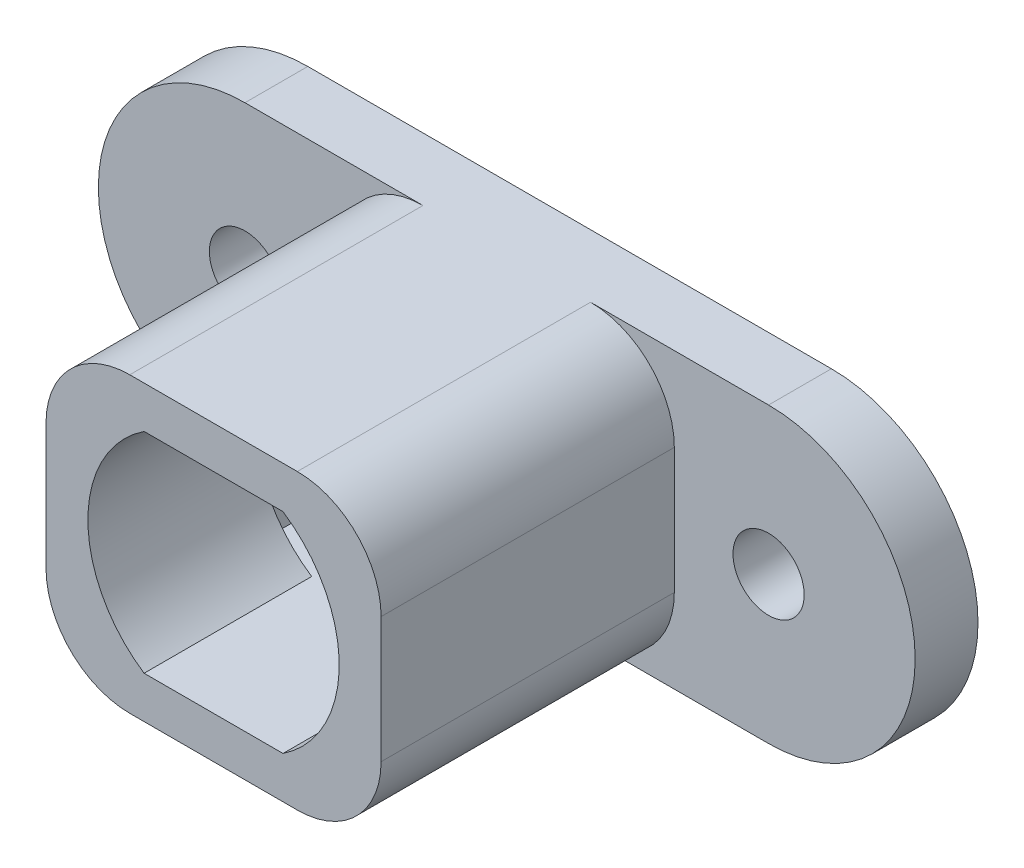
ISO-10303-21;
HEADER;
FILE_DESCRIPTION(('STEP AP214'),'2;1');
FILE_NAME('part.step','',(''),(''),'','','');
FILE_SCHEMA(('AUTOMOTIVE_DESIGN { 1 0 10303 214 1 1 1 1 }'));
ENDSEC;
DATA;
#1=APPLICATION_CONTEXT('core data for automotive mechanical design processes');
#2=APPLICATION_PROTOCOL_DEFINITION('international standard','automotive_design',2000,#1);
#3=PRODUCT_CONTEXT('',#1,'mechanical');
#4=PRODUCT('Part','Part','',(#3));
#5=PRODUCT_RELATED_PRODUCT_CATEGORY('part','',(#4));
#6=PRODUCT_DEFINITION_FORMATION('','',#4);
#7=PRODUCT_DEFINITION_CONTEXT('part definition',#1,'design');
#8=PRODUCT_DEFINITION('design','',#6,#7);
#9=PRODUCT_DEFINITION_SHAPE('','',#8);
#10=(LENGTH_UNIT() NAMED_UNIT(*) SI_UNIT(.MILLI.,.METRE.));
#11=(NAMED_UNIT(*) PLANE_ANGLE_UNIT() SI_UNIT($,.RADIAN.));
#12=(NAMED_UNIT(*) SI_UNIT($,.STERADIAN.) SOLID_ANGLE_UNIT());
#13=UNCERTAINTY_MEASURE_WITH_UNIT(LENGTH_MEASURE(1.E-05),#10,'distance_accuracy_value','');
#14=(GEOMETRIC_REPRESENTATION_CONTEXT(3) GLOBAL_UNCERTAINTY_ASSIGNED_CONTEXT((#13)) GLOBAL_UNIT_ASSIGNED_CONTEXT((#10,
#11,#12)) REPRESENTATION_CONTEXT('',''));
#15=CARTESIAN_POINT('',(0.,0.,0.));
#16=DIRECTION('',(0.,0.,1.));
#17=DIRECTION('',(1.,0.,0.));
#18=AXIS2_PLACEMENT_3D('',#15,#16,#17);
#19=CARTESIAN_POINT('',(12.5,0.,3.));
#20=DIRECTION('',(0.,0.,-1.));
#21=DIRECTION('',(-1.,0.,0.));
#22=AXIS2_PLACEMENT_3D('',#19,#20,#21);
#23=PLANE('',#22);
#24=CARTESIAN_POINT('',(12.5,0.,3.));
#25=DIRECTION('',(0.,0.,1.));
#26=DIRECTION('',(1.,0.,0.));
#27=AXIS2_PLACEMENT_3D('',#24,#25,#26);
#28=CIRCLE('',#27,1.7);
#29=CARTESIAN_POINT('',(14.2,0.,3.));
#30=VERTEX_POINT('',#29);
#31=EDGE_CURVE('E316',#30,#30,#28,.T.);
#32=ORIENTED_EDGE('',*,*,#31,.F.);
#33=EDGE_LOOP('',(#32));
#34=FACE_BOUND('',#33,.T.);
#35=DIRECTION('',(0.,1.,0.));
#36=VECTOR('',#35,1.);
#37=CARTESIAN_POINT('',(8.,7.,3.));
#38=LINE('',#37,#36);
#39=CARTESIAN_POINT('',(8.,-3.,3.));
#40=VERTEX_POINT('',#39);
#41=CARTESIAN_POINT('',(8.,3.,3.));
#42=VERTEX_POINT('',#41);
#43=EDGE_CURVE('E242',#40,#42,#38,.T.);
#44=ORIENTED_EDGE('',*,*,#43,.F.);
#45=CARTESIAN_POINT('',(4.,-3.,3.));
#46=DIRECTION('',(0.,0.,-1.));
#47=DIRECTION('',(-1.,0.,0.));
#48=AXIS2_PLACEMENT_3D('',#45,#46,#47);
#49=CIRCLE('',#48,4.);
#50=CARTESIAN_POINT('',(4.,-7.,3.));
#51=VERTEX_POINT('',#50);
#52=EDGE_CURVE('E345',#40,#51,#49,.T.);
#53=ORIENTED_EDGE('',*,*,#52,.T.);
#54=DIRECTION('',(1.,0.,0.));
#55=VECTOR('',#54,1.);
#56=CARTESIAN_POINT('',(-12.5,-7.,3.));
#57=LINE('',#56,#55);
#58=CARTESIAN_POINT('',(12.5,-7.,3.));
#59=VERTEX_POINT('',#58);
#60=EDGE_CURVE('E290',#51,#59,#57,.T.);
#61=ORIENTED_EDGE('',*,*,#60,.T.);
#62=CARTESIAN_POINT('',(12.5,0.,3.));
#63=DIRECTION('',(0.,0.,1.));
#64=DIRECTION('',(-1.,0.,0.));
#65=AXIS2_PLACEMENT_3D('',#62,#63,#64);
#66=CIRCLE('',#65,7.);
#67=CARTESIAN_POINT('',(12.5,7.,3.));
#68=VERTEX_POINT('',#67);
#69=EDGE_CURVE('E284',#59,#68,#66,.T.);
#70=ORIENTED_EDGE('',*,*,#69,.T.);
#71=DIRECTION('',(-1.,0.,0.));
#72=VECTOR('',#71,1.);
#73=CARTESIAN_POINT('',(-12.5,7.,3.));
#74=LINE('',#73,#72);
#75=CARTESIAN_POINT('',(4.,7.,3.));
#76=VERTEX_POINT('',#75);
#77=EDGE_CURVE('E55',#68,#76,#74,.T.);
#78=ORIENTED_EDGE('',*,*,#77,.T.);
#79=CARTESIAN_POINT('',(4.,3.,3.));
#80=DIRECTION('',(0.,0.,-1.));
#81=DIRECTION('',(-1.,0.,0.));
#82=AXIS2_PLACEMENT_3D('',#79,#80,#81);
#83=CIRCLE('',#82,4.);
#84=EDGE_CURVE('E48',#76,#42,#83,.T.);
#85=ORIENTED_EDGE('',*,*,#84,.T.);
#86=EDGE_LOOP('',(#44,#53,#61,#70,#78,#85));
#87=FACE_BOUND('',#86,.T.);
#88=ADVANCED_FACE('F40',(#34,#87),#23,.F.);
#89=CARTESIAN_POINT('',(-12.5,0.,3.));
#90=DIRECTION('',(0.,0.,1.));
#91=DIRECTION('',(1.,0.,0.));
#92=AXIS2_PLACEMENT_3D('',#89,#90,#91);
#93=CIRCLE('',#92,1.7);
#94=CARTESIAN_POINT('',(-10.8,0.,3.));
#95=VERTEX_POINT('',#94);
#96=EDGE_CURVE('E317',#95,#95,#93,.T.);
#97=ORIENTED_EDGE('',*,*,#96,.F.);
#98=EDGE_LOOP('',(#97));
#99=FACE_BOUND('',#98,.T.);
#100=DIRECTION('',(0.,-1.,0.));
#101=VECTOR('',#100,1.);
#102=CARTESIAN_POINT('',(-8.,7.,3.));
#103=LINE('',#102,#101);
#104=CARTESIAN_POINT('',(-8.,3.,3.));
#105=VERTEX_POINT('',#104);
#106=CARTESIAN_POINT('',(-8.,-3.,3.));
#107=VERTEX_POINT('',#106);
#108=EDGE_CURVE('E243',#105,#107,#103,.T.);
#109=ORIENTED_EDGE('',*,*,#108,.F.);
#110=CARTESIAN_POINT('',(-4.,3.,3.));
#111=DIRECTION('',(0.,0.,-1.));
#112=DIRECTION('',(-1.,0.,0.));
#113=AXIS2_PLACEMENT_3D('',#110,#111,#112);
#114=CIRCLE('',#113,4.);
#115=CARTESIAN_POINT('',(-4.,7.,3.));
#116=VERTEX_POINT('',#115);
#117=EDGE_CURVE('E12',#105,#116,#114,.T.);
#118=ORIENTED_EDGE('',*,*,#117,.T.);
#119=CARTESIAN_POINT('',(-12.5,7.,3.));
#120=VERTEX_POINT('',#119);
#121=EDGE_CURVE('E63',#116,#120,#74,.T.);
#122=ORIENTED_EDGE('',*,*,#121,.T.);
#123=CARTESIAN_POINT('',(-12.5,0.,3.));
#124=DIRECTION('',(0.,0.,1.));
#125=DIRECTION('',(1.,0.,0.));
#126=AXIS2_PLACEMENT_3D('',#123,#124,#125);
#127=CIRCLE('',#126,7.);
#128=CARTESIAN_POINT('',(-12.5,-7.,3.));
#129=VERTEX_POINT('',#128);
#130=EDGE_CURVE('E288',#120,#129,#127,.T.);
#131=ORIENTED_EDGE('',*,*,#130,.T.);
#132=CARTESIAN_POINT('',(-4.,-7.,3.));
#133=VERTEX_POINT('',#132);
#134=EDGE_CURVE('E291',#129,#133,#57,.T.);
#135=ORIENTED_EDGE('',*,*,#134,.T.);
#136=CARTESIAN_POINT('',(-4.,-3.,3.));
#137=DIRECTION('',(0.,0.,-1.));
#138=DIRECTION('',(-1.,0.,0.));
#139=AXIS2_PLACEMENT_3D('',#136,#137,#138);
#140=CIRCLE('',#139,4.);
#141=EDGE_CURVE('E348',#133,#107,#140,.T.);
#142=ORIENTED_EDGE('',*,*,#141,.T.);
#143=EDGE_LOOP('',(#109,#118,#122,#131,#135,#142));
#144=FACE_BOUND('',#143,.T.);
#145=ADVANCED_FACE('F400',(#99,#144),#23,.F.);
#146=CARTESIAN_POINT('',(12.5,0.,0.));
#147=DIRECTION('',(0.,0.,-1.));
#148=DIRECTION('',(-1.,0.,0.));
#149=AXIS2_PLACEMENT_3D('',#146,#147,#148);
#150=PLANE('',#149);
#151=CARTESIAN_POINT('',(-12.5,0.,0.));
#152=DIRECTION('',(0.,0.,-1.));
#153=DIRECTION('',(-1.,0.,0.));
#154=AXIS2_PLACEMENT_3D('',#151,#152,#153);
#155=CIRCLE('',#154,1.7);
#156=CARTESIAN_POINT('',(-14.2,0.,0.));
#157=VERTEX_POINT('',#156);
#158=EDGE_CURVE('E313',#157,#157,#155,.T.);
#159=ORIENTED_EDGE('',*,*,#158,.F.);
#160=EDGE_LOOP('',(#159));
#161=FACE_BOUND('',#160,.T.);
#162=CARTESIAN_POINT('',(12.5,0.,0.));
#163=DIRECTION('',(0.,0.,-1.));
#164=DIRECTION('',(-1.,0.,0.));
#165=AXIS2_PLACEMENT_3D('',#162,#163,#164);
#166=CIRCLE('',#165,1.7);
#167=CARTESIAN_POINT('',(10.8,0.,0.));
#168=VERTEX_POINT('',#167);
#169=EDGE_CURVE('E419',#168,#168,#166,.T.);
#170=ORIENTED_EDGE('',*,*,#169,.F.);
#171=EDGE_LOOP('',(#170));
#172=FACE_BOUND('',#171,.T.);
#173=CARTESIAN_POINT('',(12.5,0.,0.));
#174=DIRECTION('',(0.,0.,1.));
#175=DIRECTION('',(-1.,0.,0.));
#176=AXIS2_PLACEMENT_3D('',#173,#174,#175);
#177=CIRCLE('',#176,7.);
#178=CARTESIAN_POINT('',(12.5,-7.,0.));
#179=VERTEX_POINT('',#178);
#180=CARTESIAN_POINT('',(12.5,7.,0.));
#181=VERTEX_POINT('',#180);
#182=EDGE_CURVE('E283',#179,#181,#177,.T.);
#183=ORIENTED_EDGE('',*,*,#182,.F.);
#184=DIRECTION('',(1.,0.,0.));
#185=VECTOR('',#184,1.);
#186=CARTESIAN_POINT('',(-12.5,-7.,0.));
#187=LINE('',#186,#185);
#188=CARTESIAN_POINT('',(-12.5,-7.,0.));
#189=VERTEX_POINT('',#188);
#190=EDGE_CURVE('E286',#189,#179,#187,.T.);
#191=ORIENTED_EDGE('',*,*,#190,.F.);
#192=CARTESIAN_POINT('',(-12.5,0.,0.));
#193=DIRECTION('',(0.,0.,1.));
#194=DIRECTION('',(1.,0.,0.));
#195=AXIS2_PLACEMENT_3D('',#192,#193,#194);
#196=CIRCLE('',#195,7.);
#197=CARTESIAN_POINT('',(-12.5,7.,0.));
#198=VERTEX_POINT('',#197);
#199=EDGE_CURVE('E298',#198,#189,#196,.T.);
#200=ORIENTED_EDGE('',*,*,#199,.F.);
#201=DIRECTION('',(-1.,0.,0.));
#202=VECTOR('',#201,1.);
#203=CARTESIAN_POINT('',(-12.5,7.,0.));
#204=LINE('',#203,#202);
#205=EDGE_CURVE('E296',#181,#198,#204,.T.);
#206=ORIENTED_EDGE('',*,*,#205,.F.);
#207=EDGE_LOOP('',(#183,#191,#200,#206));
#208=FACE_BOUND('',#207,.T.);
#209=DIRECTION('',(1.,0.,0.));
#210=VECTOR('',#209,1.);
#211=CARTESIAN_POINT('',(-6.,-5.,0.));
#212=LINE('',#211,#210);
#213=CARTESIAN_POINT('',(-6.,-5.,0.));
#214=VERTEX_POINT('',#213);
#215=CARTESIAN_POINT('',(6.,-5.,0.));
#216=VERTEX_POINT('',#215);
#217=EDGE_CURVE('E270',#214,#216,#212,.T.);
#218=ORIENTED_EDGE('',*,*,#217,.T.);
#219=DIRECTION('',(0.,1.,0.));
#220=VECTOR('',#219,1.);
#221=CARTESIAN_POINT('',(6.,5.,0.));
#222=LINE('',#221,#220);
#223=CARTESIAN_POINT('',(6.,5.,0.));
#224=VERTEX_POINT('',#223);
#225=EDGE_CURVE('E258',#216,#224,#222,.T.);
#226=ORIENTED_EDGE('',*,*,#225,.T.);
#227=DIRECTION('',(-1.,0.,0.));
#228=VECTOR('',#227,1.);
#229=CARTESIAN_POINT('',(-6.,5.,0.));
#230=LINE('',#229,#228);
#231=CARTESIAN_POINT('',(-6.,5.,0.));
#232=VERTEX_POINT('',#231);
#233=EDGE_CURVE('E264',#224,#232,#230,.T.);
#234=ORIENTED_EDGE('',*,*,#233,.T.);
#235=DIRECTION('',(0.,-1.,0.));
#236=VECTOR('',#235,1.);
#237=CARTESIAN_POINT('',(-6.,5.,0.));
#238=LINE('',#237,#236);
#239=EDGE_CURVE('E267',#232,#214,#238,.T.);
#240=ORIENTED_EDGE('',*,*,#239,.T.);
#241=EDGE_LOOP('',(#218,#226,#234,#240));
#242=FACE_BOUND('',#241,.T.);
#243=ADVANCED_FACE('F397',(#161,#172,#208,#242),#150,.T.);
#244=CARTESIAN_POINT('',(12.5,0.,3.));
#245=DIRECTION('',(0.,0.,-1.));
#246=DIRECTION('',(-1.,0.,0.));
#247=AXIS2_PLACEMENT_3D('',#244,#245,#246);
#248=CYLINDRICAL_SURFACE('',#247,7.);
#249=ORIENTED_EDGE('',*,*,#182,.T.);
#250=DIRECTION('',(0.,0.,-1.));
#251=VECTOR('',#250,1.);
#252=CARTESIAN_POINT('',(12.5,7.,3.));
#253=LINE('',#252,#251);
#254=EDGE_CURVE('E309',#68,#181,#253,.T.);
#255=ORIENTED_EDGE('',*,*,#254,.F.);
#256=ORIENTED_EDGE('',*,*,#69,.F.);
#257=DIRECTION('',(0.,0.,-1.));
#258=VECTOR('',#257,1.);
#259=CARTESIAN_POINT('',(12.5,-7.,3.));
#260=LINE('',#259,#258);
#261=EDGE_CURVE('E293',#59,#179,#260,.T.);
#262=ORIENTED_EDGE('',*,*,#261,.T.);
#263=EDGE_LOOP('',(#249,#255,#256,#262));
#264=FACE_BOUND('',#263,.T.);
#265=ADVANCED_FACE('F390',(#264),#248,.T.);
#266=CARTESIAN_POINT('',(-12.5,7.,3.));
#267=DIRECTION('',(0.,-1.,0.));
#268=DIRECTION('',(0.,0.,-1.));
#269=AXIS2_PLACEMENT_3D('',#266,#267,#268);
#270=PLANE('',#269);
#271=DIRECTION('',(-1.,0.,0.));
#272=VECTOR('',#271,1.);
#273=CARTESIAN_POINT('',(8.,7.,17.));
#274=LINE('',#273,#272);
#275=CARTESIAN_POINT('',(4.,7.,17.));
#276=VERTEX_POINT('',#275);
#277=CARTESIAN_POINT('',(-4.,7.,17.));
#278=VERTEX_POINT('',#277);
#279=EDGE_CURVE('E233',#276,#278,#274,.T.);
#280=ORIENTED_EDGE('',*,*,#279,.F.);
#281=DIRECTION('',(0.,0.,-1.));
#282=VECTOR('',#281,1.);
#283=CARTESIAN_POINT('',(4.,7.,3.));
#284=LINE('',#283,#282);
#285=EDGE_CURVE('E342',#276,#76,#284,.T.);
#286=ORIENTED_EDGE('',*,*,#285,.T.);
#287=ORIENTED_EDGE('',*,*,#77,.F.);
#288=ORIENTED_EDGE('',*,*,#254,.T.);
#289=ORIENTED_EDGE('',*,*,#205,.T.);
#290=DIRECTION('',(0.,0.,-1.));
#291=VECTOR('',#290,1.);
#292=CARTESIAN_POINT('',(-12.5,7.,3.));
#293=LINE('',#292,#291);
#294=EDGE_CURVE('E306',#120,#198,#293,.T.);
#295=ORIENTED_EDGE('',*,*,#294,.F.);
#296=ORIENTED_EDGE('',*,*,#121,.F.);
#297=DIRECTION('',(0.,0.,-1.));
#298=VECTOR('',#297,1.);
#299=CARTESIAN_POINT('',(-4.,7.,3.));
#300=LINE('',#299,#298);
#301=EDGE_CURVE('E340',#116,#278,#300,.F.);
#302=ORIENTED_EDGE('',*,*,#301,.T.);
#303=EDGE_LOOP('',(#280,#286,#287,#288,#289,#295,#296,#302));
#304=FACE_BOUND('',#303,.T.);
#305=ADVANCED_FACE('F362',(#304),#270,.F.);
#306=CARTESIAN_POINT('',(-12.5,0.,3.));
#307=DIRECTION('',(0.,0.,-1.));
#308=DIRECTION('',(-1.,0.,0.));
#309=AXIS2_PLACEMENT_3D('',#306,#307,#308);
#310=CYLINDRICAL_SURFACE('',#309,7.);
#311=ORIENTED_EDGE('',*,*,#199,.T.);
#312=DIRECTION('',(0.,0.,-1.));
#313=VECTOR('',#312,1.);
#314=CARTESIAN_POINT('',(-12.5,-7.,3.));
#315=LINE('',#314,#313);
#316=EDGE_CURVE('E303',#129,#189,#315,.T.);
#317=ORIENTED_EDGE('',*,*,#316,.F.);
#318=ORIENTED_EDGE('',*,*,#130,.F.);
#319=ORIENTED_EDGE('',*,*,#294,.T.);
#320=EDGE_LOOP('',(#311,#317,#318,#319));
#321=FACE_BOUND('',#320,.T.);
#322=ADVANCED_FACE('F395',(#321),#310,.T.);
#323=CARTESIAN_POINT('',(-12.5,-7.,3.));
#324=DIRECTION('',(0.,1.,0.));
#325=DIRECTION('',(0.,0.,1.));
#326=AXIS2_PLACEMENT_3D('',#323,#324,#325);
#327=PLANE('',#326);
#328=ORIENTED_EDGE('',*,*,#60,.F.);
#329=DIRECTION('',(0.,0.,-1.));
#330=VECTOR('',#329,1.);
#331=CARTESIAN_POINT('',(4.,-7.,3.));
#332=LINE('',#331,#330);
#333=CARTESIAN_POINT('',(4.,-7.,17.));
#334=VERTEX_POINT('',#333);
#335=EDGE_CURVE('E325',#51,#334,#332,.F.);
#336=ORIENTED_EDGE('',*,*,#335,.T.);
#337=DIRECTION('',(1.,0.,0.));
#338=VECTOR('',#337,1.);
#339=CARTESIAN_POINT('',(-8.,-7.,17.));
#340=LINE('',#339,#338);
#341=CARTESIAN_POINT('',(-4.,-7.,17.));
#342=VERTEX_POINT('',#341);
#343=EDGE_CURVE('E239',#342,#334,#340,.T.);
#344=ORIENTED_EDGE('',*,*,#343,.F.);
#345=DIRECTION('',(0.,0.,-1.));
#346=VECTOR('',#345,1.);
#347=CARTESIAN_POINT('',(-4.,-7.,3.));
#348=LINE('',#347,#346);
#349=EDGE_CURVE('E322',#342,#133,#348,.T.);
#350=ORIENTED_EDGE('',*,*,#349,.T.);
#351=ORIENTED_EDGE('',*,*,#134,.F.);
#352=ORIENTED_EDGE('',*,*,#316,.T.);
#353=ORIENTED_EDGE('',*,*,#190,.T.);
#354=ORIENTED_EDGE('',*,*,#261,.F.);
#355=EDGE_LOOP('',(#328,#336,#344,#350,#351,#352,#353,#354));
#356=FACE_BOUND('',#355,.T.);
#357=ADVANCED_FACE('F379',(#356),#327,.F.);
#358=CARTESIAN_POINT('',(6.,5.,3.));
#359=DIRECTION('',(-1.,0.,0.));
#360=DIRECTION('',(0.,-1.,0.));
#361=AXIS2_PLACEMENT_3D('',#358,#359,#360);
#362=PLANE('',#361);
#363=ORIENTED_EDGE('',*,*,#225,.F.);
#364=DIRECTION('',(0.,0.,-1.));
#365=VECTOR('',#364,1.);
#366=CARTESIAN_POINT('',(6.,-5.,3.));
#367=LINE('',#366,#365);
#368=CARTESIAN_POINT('',(6.,-5.,9.));
#369=VERTEX_POINT('',#368);
#370=EDGE_CURVE('E273',#369,#216,#367,.T.);
#371=ORIENTED_EDGE('',*,*,#370,.F.);
#372=DIRECTION('',(0.,-1.,0.));
#373=VECTOR('',#372,1.);
#374=CARTESIAN_POINT('',(6.,-5.,9.));
#375=LINE('',#374,#373);
#376=CARTESIAN_POINT('',(6.,0.,9.));
#377=VERTEX_POINT('',#376);
#378=EDGE_CURVE('E251',#377,#369,#375,.T.);
#379=ORIENTED_EDGE('',*,*,#378,.F.);
#380=CARTESIAN_POINT('',(6.,5.,9.));
#381=VERTEX_POINT('',#380);
#382=EDGE_CURVE('E259',#381,#377,#375,.T.);
#383=ORIENTED_EDGE('',*,*,#382,.F.);
#384=DIRECTION('',(0.,0.,-1.));
#385=VECTOR('',#384,1.);
#386=CARTESIAN_POINT('',(6.,5.,3.));
#387=LINE('',#386,#385);
#388=EDGE_CURVE('E280',#381,#224,#387,.T.);
#389=ORIENTED_EDGE('',*,*,#388,.T.);
#390=EDGE_LOOP('',(#363,#371,#379,#383,#389));
#391=FACE_BOUND('',#390,.T.);
#392=ADVANCED_FACE('F407',(#391),#362,.T.);
#393=CARTESIAN_POINT('',(-6.,5.,3.));
#394=DIRECTION('',(0.,-1.,0.));
#395=DIRECTION('',(0.,0.,-1.));
#396=AXIS2_PLACEMENT_3D('',#393,#394,#395);
#397=PLANE('',#396);
#398=ORIENTED_EDGE('',*,*,#233,.F.);
#399=ORIENTED_EDGE('',*,*,#388,.F.);
#400=DIRECTION('',(1.,0.,0.));
#401=VECTOR('',#400,1.);
#402=CARTESIAN_POINT('',(6.,5.,9.));
#403=LINE('',#402,#401);
#404=CARTESIAN_POINT('',(3.3166247903554,5.,9.));
#405=VERTEX_POINT('',#404);
#406=EDGE_CURVE('E252',#405,#381,#403,.T.);
#407=ORIENTED_EDGE('',*,*,#406,.F.);
#408=DIRECTION('',(0.,0.,-1.));
#409=VECTOR('',#408,1.);
#410=CARTESIAN_POINT('',(3.3166247903554,5.,17.));
#411=LINE('',#410,#409);
#412=CARTESIAN_POINT('',(3.3166247903554,5.,17.));
#413=VERTEX_POINT('',#412);
#414=EDGE_CURVE('E227',#413,#405,#411,.T.);
#415=ORIENTED_EDGE('',*,*,#414,.F.);
#416=DIRECTION('',(-1.,0.,0.));
#417=VECTOR('',#416,1.);
#418=CARTESIAN_POINT('',(3.3166247903554,5.,17.));
#419=LINE('',#418,#417);
#420=CARTESIAN_POINT('',(-3.3166247903554,5.,17.));
#421=VERTEX_POINT('',#420);
#422=EDGE_CURVE('E214',#413,#421,#419,.T.);
#423=ORIENTED_EDGE('',*,*,#422,.T.);
#424=DIRECTION('',(0.,0.,-1.));
#425=VECTOR('',#424,1.);
#426=CARTESIAN_POINT('',(-3.3166247903554,5.,17.));
#427=LINE('',#426,#425);
#428=CARTESIAN_POINT('',(-3.3166247903554,5.,9.));
#429=VERTEX_POINT('',#428);
#430=EDGE_CURVE('E190',#421,#429,#427,.T.);
#431=ORIENTED_EDGE('',*,*,#430,.T.);
#432=CARTESIAN_POINT('',(-6.,5.,9.));
#433=VERTEX_POINT('',#432);
#434=EDGE_CURVE('E249',#433,#429,#403,.T.);
#435=ORIENTED_EDGE('',*,*,#434,.F.);
#436=DIRECTION('',(0.,0.,-1.));
#437=VECTOR('',#436,1.);
#438=CARTESIAN_POINT('',(-6.,5.,3.));
#439=LINE('',#438,#437);
#440=EDGE_CURVE('E278',#433,#232,#439,.T.);
#441=ORIENTED_EDGE('',*,*,#440,.T.);
#442=EDGE_LOOP('',(#398,#399,#407,#415,#423,#431,#435,#441));
#443=FACE_BOUND('',#442,.T.);
#444=ADVANCED_FACE('F411',(#443),#397,.T.);
#445=CARTESIAN_POINT('',(-6.,5.,3.));
#446=DIRECTION('',(1.,0.,0.));
#447=DIRECTION('',(0.,1.,0.));
#448=AXIS2_PLACEMENT_3D('',#445,#446,#447);
#449=PLANE('',#448);
#450=ORIENTED_EDGE('',*,*,#239,.F.);
#451=ORIENTED_EDGE('',*,*,#440,.F.);
#452=DIRECTION('',(0.,1.,0.));
#453=VECTOR('',#452,1.);
#454=CARTESIAN_POINT('',(-6.,5.,9.));
#455=LINE('',#454,#453);
#456=CARTESIAN_POINT('',(-6.,0.,9.));
#457=VERTEX_POINT('',#456);
#458=EDGE_CURVE('E246',#457,#433,#455,.T.);
#459=ORIENTED_EDGE('',*,*,#458,.F.);
#460=CARTESIAN_POINT('',(-5.99999999999999,-5.,9.));
#461=VERTEX_POINT('',#460);
#462=EDGE_CURVE('E253',#461,#457,#455,.T.);
#463=ORIENTED_EDGE('',*,*,#462,.F.);
#464=DIRECTION('',(0.,0.,-1.));
#465=VECTOR('',#464,1.);
#466=CARTESIAN_POINT('',(-6.,-5.,3.));
#467=LINE('',#466,#465);
#468=EDGE_CURVE('E276',#461,#214,#467,.T.);
#469=ORIENTED_EDGE('',*,*,#468,.T.);
#470=EDGE_LOOP('',(#450,#451,#459,#463,#469));
#471=FACE_BOUND('',#470,.T.);
#472=ADVANCED_FACE('F416',(#471),#449,.T.);
#473=CARTESIAN_POINT('',(-6.,-5.,3.));
#474=DIRECTION('',(0.,1.,0.));
#475=DIRECTION('',(0.,0.,1.));
#476=AXIS2_PLACEMENT_3D('',#473,#474,#475);
#477=PLANE('',#476);
#478=ORIENTED_EDGE('',*,*,#217,.F.);
#479=ORIENTED_EDGE('',*,*,#468,.F.);
#480=DIRECTION('',(-1.,0.,0.));
#481=VECTOR('',#480,1.);
#482=CARTESIAN_POINT('',(-5.99999999999999,-5.,9.));
#483=LINE('',#482,#481);
#484=CARTESIAN_POINT('',(-3.31662479035541,-5.,9.));
#485=VERTEX_POINT('',#484);
#486=EDGE_CURVE('E204',#485,#461,#483,.T.);
#487=ORIENTED_EDGE('',*,*,#486,.F.);
#488=DIRECTION('',(0.,0.,-1.));
#489=VECTOR('',#488,1.);
#490=CARTESIAN_POINT('',(-3.31662479035541,-5.,17.));
#491=LINE('',#490,#489);
#492=CARTESIAN_POINT('',(-3.31662479035541,-5.,17.));
#493=VERTEX_POINT('',#492);
#494=EDGE_CURVE('E188',#493,#485,#491,.T.);
#495=ORIENTED_EDGE('',*,*,#494,.F.);
#496=DIRECTION('',(1.,0.,0.));
#497=VECTOR('',#496,1.);
#498=CARTESIAN_POINT('',(3.3166247903554,-5.,17.));
#499=LINE('',#498,#497);
#500=CARTESIAN_POINT('',(3.3166247903554,-5.,17.));
#501=VERTEX_POINT('',#500);
#502=EDGE_CURVE('E194',#493,#501,#499,.T.);
#503=ORIENTED_EDGE('',*,*,#502,.T.);
#504=DIRECTION('',(0.,0.,-1.));
#505=VECTOR('',#504,1.);
#506=CARTESIAN_POINT('',(3.3166247903554,-5.,17.));
#507=LINE('',#506,#505);
#508=CARTESIAN_POINT('',(3.31662479035541,-5.,9.));
#509=VERTEX_POINT('',#508);
#510=EDGE_CURVE('E207',#501,#509,#507,.T.);
#511=ORIENTED_EDGE('',*,*,#510,.T.);
#512=EDGE_CURVE('E256',#369,#509,#483,.T.);
#513=ORIENTED_EDGE('',*,*,#512,.F.);
#514=ORIENTED_EDGE('',*,*,#370,.T.);
#515=EDGE_LOOP('',(#478,#479,#487,#495,#503,#511,#513,#514));
#516=FACE_BOUND('',#515,.T.);
#517=ADVANCED_FACE('F199',(#516),#477,.T.);
#518=CARTESIAN_POINT('',(8.,7.,39.2602916254693));
#519=DIRECTION('',(-1.,0.,0.));
#520=DIRECTION('',(0.,0.,1.));
#521=AXIS2_PLACEMENT_3D('',#518,#519,#520);
#522=PLANE('',#521);
#523=DIRECTION('',(0.,1.,0.));
#524=VECTOR('',#523,1.);
#525=CARTESIAN_POINT('',(8.,-7.,17.));
#526=LINE('',#525,#524);
#527=CARTESIAN_POINT('',(8.,-3.,17.));
#528=VERTEX_POINT('',#527);
#529=CARTESIAN_POINT('',(8.,3.,17.));
#530=VERTEX_POINT('',#529);
#531=EDGE_CURVE('E206',#528,#530,#526,.T.);
#532=ORIENTED_EDGE('',*,*,#531,.F.);
#533=DIRECTION('',(0.,0.,-1.));
#534=VECTOR('',#533,1.);
#535=CARTESIAN_POINT('',(8.,-3.,39.2602916254693));
#536=LINE('',#535,#534);
#537=EDGE_CURVE('E319',#528,#40,#536,.T.);
#538=ORIENTED_EDGE('',*,*,#537,.T.);
#539=ORIENTED_EDGE('',*,*,#43,.T.);
#540=DIRECTION('',(0.,0.,-1.));
#541=VECTOR('',#540,1.);
#542=CARTESIAN_POINT('',(8.,3.,39.2602916254693));
#543=LINE('',#542,#541);
#544=EDGE_CURVE('E312',#42,#530,#543,.F.);
#545=ORIENTED_EDGE('',*,*,#544,.T.);
#546=EDGE_LOOP('',(#532,#538,#539,#545));
#547=FACE_BOUND('',#546,.T.);
#548=ADVANCED_FACE('F355',(#547),#522,.F.);
#549=CARTESIAN_POINT('',(-8.,7.,39.2602916254693));
#550=DIRECTION('',(1.,0.,0.));
#551=DIRECTION('',(0.,0.,-1.));
#552=AXIS2_PLACEMENT_3D('',#549,#550,#551);
#553=PLANE('',#552);
#554=ORIENTED_EDGE('',*,*,#108,.T.);
#555=DIRECTION('',(0.,0.,-1.));
#556=VECTOR('',#555,1.);
#557=CARTESIAN_POINT('',(-8.,-3.,39.2602916254693));
#558=LINE('',#557,#556);
#559=CARTESIAN_POINT('',(-8.,-3.,17.));
#560=VERTEX_POINT('',#559);
#561=EDGE_CURVE('E338',#107,#560,#558,.F.);
#562=ORIENTED_EDGE('',*,*,#561,.T.);
#563=DIRECTION('',(0.,-1.,0.));
#564=VECTOR('',#563,1.);
#565=CARTESIAN_POINT('',(-8.,7.,17.));
#566=LINE('',#565,#564);
#567=CARTESIAN_POINT('',(-8.,3.,17.));
#568=VERTEX_POINT('',#567);
#569=EDGE_CURVE('E236',#568,#560,#566,.T.);
#570=ORIENTED_EDGE('',*,*,#569,.F.);
#571=DIRECTION('',(0.,0.,-1.));
#572=VECTOR('',#571,1.);
#573=CARTESIAN_POINT('',(-8.,3.,39.2602916254693));
#574=LINE('',#573,#572);
#575=EDGE_CURVE('E335',#568,#105,#574,.T.);
#576=ORIENTED_EDGE('',*,*,#575,.T.);
#577=EDGE_LOOP('',(#554,#562,#570,#576));
#578=FACE_BOUND('',#577,.T.);
#579=ADVANCED_FACE('F369',(#578),#553,.F.);
#580=CARTESIAN_POINT('',(0.,0.,9.));
#581=DIRECTION('',(0.,0.,1.));
#582=DIRECTION('',(1.,0.,0.));
#583=AXIS2_PLACEMENT_3D('',#580,#581,#582);
#584=PLANE('',#583);
#585=CARTESIAN_POINT('',(0.,0.,9.));
#586=DIRECTION('',(0.,0.,1.));
#587=DIRECTION('',(1.,0.,0.));
#588=AXIS2_PLACEMENT_3D('',#585,#586,#587);
#589=CIRCLE('',#588,6.);
#590=EDGE_CURVE('E222',#377,#405,#589,.T.);
#591=ORIENTED_EDGE('',*,*,#590,.T.);
#592=ORIENTED_EDGE('',*,*,#406,.T.);
#593=ORIENTED_EDGE('',*,*,#382,.T.);
#594=EDGE_LOOP('',(#591,#592,#593));
#595=FACE_BOUND('',#594,.T.);
#596=ADVANCED_FACE('F430',(#595),#584,.F.);
#597=EDGE_CURVE('E195',#509,#377,#589,.T.);
#598=ORIENTED_EDGE('',*,*,#597,.T.);
#599=ORIENTED_EDGE('',*,*,#378,.T.);
#600=ORIENTED_EDGE('',*,*,#512,.T.);
#601=EDGE_LOOP('',(#598,#599,#600));
#602=FACE_BOUND('',#601,.T.);
#603=ADVANCED_FACE('F423',(#602),#584,.F.);
#604=ORIENTED_EDGE('',*,*,#458,.T.);
#605=ORIENTED_EDGE('',*,*,#434,.T.);
#606=CARTESIAN_POINT('',(0.,0.,9.));
#607=DIRECTION('',(0.,0.,1.));
#608=DIRECTION('',(-1.,0.,0.));
#609=AXIS2_PLACEMENT_3D('',#606,#607,#608);
#610=CIRCLE('',#609,6.);
#611=EDGE_CURVE('E219',#429,#457,#610,.T.);
#612=ORIENTED_EDGE('',*,*,#611,.T.);
#613=EDGE_LOOP('',(#604,#605,#612));
#614=FACE_BOUND('',#613,.T.);
#615=ADVANCED_FACE('F421',(#614),#584,.F.);
#616=CARTESIAN_POINT('',(0.,0.,17.));
#617=DIRECTION('',(0.,0.,1.));
#618=DIRECTION('',(1.,0.,0.));
#619=AXIS2_PLACEMENT_3D('',#616,#617,#618);
#620=PLANE('',#619);
#621=ORIENTED_EDGE('',*,*,#343,.T.);
#622=CARTESIAN_POINT('',(4.,-3.,17.));
#623=DIRECTION('',(0.,0.,1.));
#624=DIRECTION('',(1.,0.,0.));
#625=AXIS2_PLACEMENT_3D('',#622,#623,#624);
#626=CIRCLE('',#625,4.);
#627=EDGE_CURVE('E333',#334,#528,#626,.T.);
#628=ORIENTED_EDGE('',*,*,#627,.T.);
#629=ORIENTED_EDGE('',*,*,#531,.T.);
#630=CARTESIAN_POINT('',(4.,3.,17.));
#631=DIRECTION('',(0.,0.,1.));
#632=DIRECTION('',(1.,0.,0.));
#633=AXIS2_PLACEMENT_3D('',#630,#631,#632);
#634=CIRCLE('',#633,4.);
#635=EDGE_CURVE('E329',#530,#276,#634,.T.);
#636=ORIENTED_EDGE('',*,*,#635,.T.);
#637=ORIENTED_EDGE('',*,*,#279,.T.);
#638=CARTESIAN_POINT('',(-4.,3.,17.));
#639=DIRECTION('',(0.,0.,1.));
#640=DIRECTION('',(1.,0.,0.));
#641=AXIS2_PLACEMENT_3D('',#638,#639,#640);
#642=CIRCLE('',#641,4.);
#643=EDGE_CURVE('E327',#278,#568,#642,.T.);
#644=ORIENTED_EDGE('',*,*,#643,.T.);
#645=ORIENTED_EDGE('',*,*,#569,.T.);
#646=CARTESIAN_POINT('',(-4.,-3.,17.));
#647=DIRECTION('',(0.,0.,1.));
#648=DIRECTION('',(1.,0.,0.));
#649=AXIS2_PLACEMENT_3D('',#646,#647,#648);
#650=CIRCLE('',#649,4.);
#651=EDGE_CURVE('E331',#560,#342,#650,.T.);
#652=ORIENTED_EDGE('',*,*,#651,.T.);
#653=EDGE_LOOP('',(#621,#628,#629,#636,#637,#644,#645,#652));
#654=FACE_BOUND('',#653,.T.);
#655=ORIENTED_EDGE('',*,*,#502,.F.);
#656=CARTESIAN_POINT('',(0.,0.,17.));
#657=DIRECTION('',(0.,0.,1.));
#658=DIRECTION('',(-1.,0.,0.));
#659=AXIS2_PLACEMENT_3D('',#656,#657,#658);
#660=CIRCLE('',#659,6.);
#661=EDGE_CURVE('E183',#421,#493,#660,.T.);
#662=ORIENTED_EDGE('',*,*,#661,.F.);
#663=ORIENTED_EDGE('',*,*,#422,.F.);
#664=CARTESIAN_POINT('',(0.,0.,17.));
#665=DIRECTION('',(0.,0.,1.));
#666=DIRECTION('',(1.,0.,0.));
#667=AXIS2_PLACEMENT_3D('',#664,#665,#666);
#668=CIRCLE('',#667,6.);
#669=EDGE_CURVE('E212',#501,#413,#668,.T.);
#670=ORIENTED_EDGE('',*,*,#669,.F.);
#671=EDGE_LOOP('',(#655,#662,#663,#670));
#672=FACE_BOUND('',#671,.T.);
#673=ADVANCED_FACE('F210',(#654,#672),#620,.T.);
#674=ORIENTED_EDGE('',*,*,#486,.T.);
#675=ORIENTED_EDGE('',*,*,#462,.T.);
#676=EDGE_CURVE('E223',#457,#485,#610,.T.);
#677=ORIENTED_EDGE('',*,*,#676,.T.);
#678=EDGE_LOOP('',(#674,#675,#677));
#679=FACE_BOUND('',#678,.T.);
#680=ADVANCED_FACE('F418',(#679),#584,.F.);
#681=CARTESIAN_POINT('',(0.,0.,17.));
#682=DIRECTION('',(0.,0.,-1.));
#683=DIRECTION('',(-1.,0.,0.));
#684=AXIS2_PLACEMENT_3D('',#681,#682,#683);
#685=CYLINDRICAL_SURFACE('',#684,6.);
#686=ORIENTED_EDGE('',*,*,#611,.F.);
#687=ORIENTED_EDGE('',*,*,#430,.F.);
#688=ORIENTED_EDGE('',*,*,#661,.T.);
#689=ORIENTED_EDGE('',*,*,#494,.T.);
#690=ORIENTED_EDGE('',*,*,#676,.F.);
#691=EDGE_LOOP('',(#686,#687,#688,#689,#690));
#692=FACE_BOUND('',#691,.T.);
#693=ADVANCED_FACE('F186',(#692),#685,.F.);
#694=CARTESIAN_POINT('',(0.,0.,17.));
#695=DIRECTION('',(0.,0.,-1.));
#696=DIRECTION('',(-1.,0.,0.));
#697=AXIS2_PLACEMENT_3D('',#694,#695,#696);
#698=CYLINDRICAL_SURFACE('',#697,6.);
#699=ORIENTED_EDGE('',*,*,#597,.F.);
#700=ORIENTED_EDGE('',*,*,#510,.F.);
#701=ORIENTED_EDGE('',*,*,#669,.T.);
#702=ORIENTED_EDGE('',*,*,#414,.T.);
#703=ORIENTED_EDGE('',*,*,#590,.F.);
#704=EDGE_LOOP('',(#699,#700,#701,#702,#703));
#705=FACE_BOUND('',#704,.T.);
#706=ADVANCED_FACE('F554',(#705),#698,.F.);
#707=CARTESIAN_POINT('',(12.5,0.,3.));
#708=DIRECTION('',(0.,0.,1.));
#709=DIRECTION('',(1.,0.,0.));
#710=AXIS2_PLACEMENT_3D('',#707,#708,#709);
#711=CYLINDRICAL_SURFACE('',#710,1.7);
#712=ORIENTED_EDGE('',*,*,#169,.T.);
#713=EDGE_LOOP('',(#712));
#714=FACE_BOUND('',#713,.T.);
#715=ORIENTED_EDGE('',*,*,#31,.T.);
#716=EDGE_LOOP('',(#715));
#717=FACE_BOUND('',#716,.T.);
#718=ADVANCED_FACE('F544',(#714,#717),#711,.F.);
#719=CARTESIAN_POINT('',(-12.5,0.,3.));
#720=DIRECTION('',(0.,0.,1.));
#721=DIRECTION('',(1.,0.,0.));
#722=AXIS2_PLACEMENT_3D('',#719,#720,#721);
#723=CYLINDRICAL_SURFACE('',#722,1.7);
#724=ORIENTED_EDGE('',*,*,#158,.T.);
#725=EDGE_LOOP('',(#724));
#726=FACE_BOUND('',#725,.T.);
#727=ORIENTED_EDGE('',*,*,#96,.T.);
#728=EDGE_LOOP('',(#727));
#729=FACE_BOUND('',#728,.T.);
#730=ADVANCED_FACE('F455',(#726,#729),#723,.F.);
#731=CARTESIAN_POINT('',(4.,-3.,39.2602916254693));
#732=DIRECTION('',(0.,0.,-1.));
#733=DIRECTION('',(-1.,0.,0.));
#734=AXIS2_PLACEMENT_3D('',#731,#732,#733);
#735=CYLINDRICAL_SURFACE('',#734,4.);
#736=ORIENTED_EDGE('',*,*,#627,.F.);
#737=ORIENTED_EDGE('',*,*,#335,.F.);
#738=ORIENTED_EDGE('',*,*,#52,.F.);
#739=ORIENTED_EDGE('',*,*,#537,.F.);
#740=EDGE_LOOP('',(#736,#737,#738,#739));
#741=FACE_BOUND('',#740,.T.);
#742=ADVANCED_FACE('F384',(#741),#735,.T.);
#743=CARTESIAN_POINT('',(-4.,-3.,3.));
#744=DIRECTION('',(0.,0.,-1.));
#745=DIRECTION('',(-1.,0.,0.));
#746=AXIS2_PLACEMENT_3D('',#743,#744,#745);
#747=CYLINDRICAL_SURFACE('',#746,4.);
#748=ORIENTED_EDGE('',*,*,#651,.F.);
#749=ORIENTED_EDGE('',*,*,#561,.F.);
#750=ORIENTED_EDGE('',*,*,#141,.F.);
#751=ORIENTED_EDGE('',*,*,#349,.F.);
#752=EDGE_LOOP('',(#748,#749,#750,#751));
#753=FACE_BOUND('',#752,.T.);
#754=ADVANCED_FACE('F374',(#753),#747,.T.);
#755=CARTESIAN_POINT('',(4.,3.,3.));
#756=DIRECTION('',(0.,0.,-1.));
#757=DIRECTION('',(-1.,0.,0.));
#758=AXIS2_PLACEMENT_3D('',#755,#756,#757);
#759=CYLINDRICAL_SURFACE('',#758,4.);
#760=ORIENTED_EDGE('',*,*,#635,.F.);
#761=ORIENTED_EDGE('',*,*,#544,.F.);
#762=ORIENTED_EDGE('',*,*,#84,.F.);
#763=ORIENTED_EDGE('',*,*,#285,.F.);
#764=EDGE_LOOP('',(#760,#761,#762,#763));
#765=FACE_BOUND('',#764,.T.);
#766=ADVANCED_FACE('F358',(#765),#759,.T.);
#767=CARTESIAN_POINT('',(-4.,3.,39.2602916254693));
#768=DIRECTION('',(0.,0.,-1.));
#769=DIRECTION('',(-1.,0.,0.));
#770=AXIS2_PLACEMENT_3D('',#767,#768,#769);
#771=CYLINDRICAL_SURFACE('',#770,4.);
#772=ORIENTED_EDGE('',*,*,#643,.F.);
#773=ORIENTED_EDGE('',*,*,#301,.F.);
#774=ORIENTED_EDGE('',*,*,#117,.F.);
#775=ORIENTED_EDGE('',*,*,#575,.F.);
#776=EDGE_LOOP('',(#772,#773,#774,#775));
#777=FACE_BOUND('',#776,.T.);
#778=ADVANCED_FACE('F42',(#777),#771,.T.);
#779=CLOSED_SHELL('',(#88,#145,#243,#265,#305,#322,#357,#392,#444,#472,#517,#548,#579,#596,#603,
#615,#673,#680,#693,#706,#718,#730,#742,#754,#766,#778));
#780=MANIFOLD_SOLID_BREP('B2',#779);
#781=ADVANCED_BREP_SHAPE_REPRESENTATION('',(#18,#780),#14);
#782=SHAPE_DEFINITION_REPRESENTATION(#9,#781);
ENDSEC;
END-ISO-10303-21;
